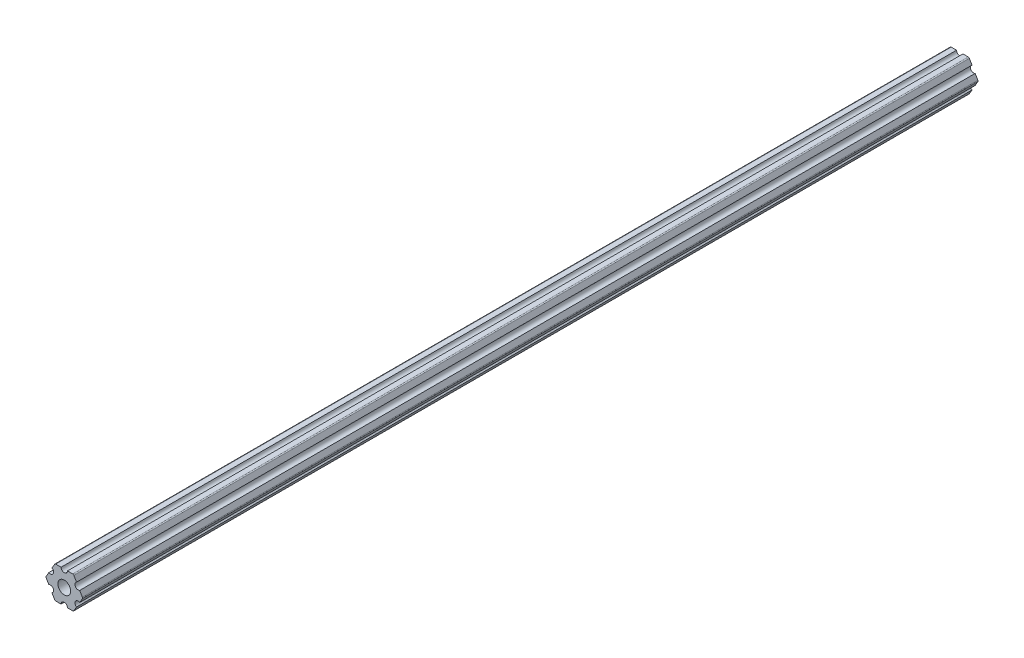
ISO-10303-21;
HEADER;
FILE_DESCRIPTION(('STEP AP214'),'2;1');
FILE_NAME('part.step','',(''),(''),'','','');
FILE_SCHEMA(('AUTOMOTIVE_DESIGN { 1 0 10303 214 1 1 1 1 }'));
ENDSEC;
DATA;
#1=APPLICATION_CONTEXT('core data for automotive mechanical design processes');
#2=APPLICATION_PROTOCOL_DEFINITION('international standard','automotive_design',2000,#1);
#3=PRODUCT_CONTEXT('',#1,'mechanical');
#4=PRODUCT('Part','Part','',(#3));
#5=PRODUCT_RELATED_PRODUCT_CATEGORY('part','',(#4));
#6=PRODUCT_DEFINITION_FORMATION('','',#4);
#7=PRODUCT_DEFINITION_CONTEXT('part definition',#1,'design');
#8=PRODUCT_DEFINITION('design','',#6,#7);
#9=PRODUCT_DEFINITION_SHAPE('','',#8);
#10=(LENGTH_UNIT() NAMED_UNIT(*) SI_UNIT(.MILLI.,.METRE.));
#11=(NAMED_UNIT(*) PLANE_ANGLE_UNIT() SI_UNIT($,.RADIAN.));
#12=(NAMED_UNIT(*) SI_UNIT($,.STERADIAN.) SOLID_ANGLE_UNIT());
#13=UNCERTAINTY_MEASURE_WITH_UNIT(LENGTH_MEASURE(1.E-05),#10,'distance_accuracy_value','');
#14=(GEOMETRIC_REPRESENTATION_CONTEXT(3) GLOBAL_UNCERTAINTY_ASSIGNED_CONTEXT((#13)) GLOBAL_UNIT_ASSIGNED_CONTEXT((#10,
#11,#12)) REPRESENTATION_CONTEXT('',''));
#15=CARTESIAN_POINT('',(0.,0.,0.));
#16=DIRECTION('',(0.,0.,1.));
#17=DIRECTION('',(1.,0.,0.));
#18=AXIS2_PLACEMENT_3D('',#15,#16,#17);
#19=CARTESIAN_POINT('',(3.66617420935418,-6.34999999999993,355.6));
#20=DIRECTION('',(-0.866025403784441,0.499999999999995,0.));
#21=DIRECTION('',(-0.499999999999995,-0.866025403784442,0.));
#22=AXIS2_PLACEMENT_3D('',#19,#20,#21);
#23=PLANE('',#22);
#24=DIRECTION('',(0.499999999999995,0.866025403784442,0.));
#25=VECTOR('',#24,1.);
#26=CARTESIAN_POINT('',(3.66617420935418,-6.34999999999993,355.6));
#27=LINE('',#26,#25);
#28=CARTESIAN_POINT('',(3.81282117772834,-6.09599999999993,355.6));
#29=VERTEX_POINT('',#28);
#30=CARTESIAN_POINT('',(4.86426131403121,-4.27485226280621,355.6));
#31=VERTEX_POINT('',#30);
#32=EDGE_CURVE('E326',#29,#31,#27,.T.);
#33=ORIENTED_EDGE('',*,*,#32,.F.);
#34=DIRECTION('',(0.,0.,-1.));
#35=VECTOR('',#34,1.);
#36=CARTESIAN_POINT('',(3.81282117772834,-6.09599999999993,355.6));
#37=LINE('',#36,#35);
#38=CARTESIAN_POINT('',(3.81282117772834,-6.09599999999993,0.));
#39=VERTEX_POINT('',#38);
#40=EDGE_CURVE('E286',#29,#39,#37,.T.);
#41=ORIENTED_EDGE('',*,*,#40,.T.);
#42=DIRECTION('',(0.499999999999995,0.866025403784442,0.));
#43=VECTOR('',#42,1.);
#44=CARTESIAN_POINT('',(3.66617420935418,-6.34999999999993,0.));
#45=LINE('',#44,#43);
#46=CARTESIAN_POINT('',(4.86426131403121,-4.27485226280621,0.));
#47=VERTEX_POINT('',#46);
#48=EDGE_CURVE('E220',#39,#47,#45,.T.);
#49=ORIENTED_EDGE('',*,*,#48,.T.);
#50=DIRECTION('',(0.,0.,1.));
#51=VECTOR('',#50,1.);
#52=CARTESIAN_POINT('',(4.86426131403121,-4.27485226280621,0.));
#53=LINE('',#52,#51);
#54=EDGE_CURVE('E381',#47,#31,#53,.T.);
#55=ORIENTED_EDGE('',*,*,#54,.T.);
#56=EDGE_LOOP('',(#33,#41,#49,#55));
#57=FACE_BOUND('',#56,.T.);
#58=ADVANCED_FACE('F36',(#57),#23,.F.);
#59=CARTESIAN_POINT('',(7.33234841870822,0.,355.6));
#60=DIRECTION('',(-0.866025403784438,-0.500000000000001,0.));
#61=DIRECTION('',(0.500000000000001,-0.866025403784438,0.));
#62=AXIS2_PLACEMENT_3D('',#59,#60,#61);
#63=PLANE('',#62);
#64=DIRECTION('',(-0.500000000000001,0.866025403784438,0.));
#65=VECTOR('',#64,1.);
#66=CARTESIAN_POINT('',(7.33234841870822,0.,355.6));
#67=LINE('',#66,#65);
#68=CARTESIAN_POINT('',(7.18570145033405,0.253999999999999,355.6));
#69=VERTEX_POINT('',#68);
#70=CARTESIAN_POINT('',(6.13426131403116,2.07514773719376,355.6));
#71=VERTEX_POINT('',#70);
#72=EDGE_CURVE('E328',#69,#71,#67,.T.);
#73=ORIENTED_EDGE('',*,*,#72,.F.);
#74=DIRECTION('',(0.,0.,-1.));
#75=VECTOR('',#74,1.);
#76=CARTESIAN_POINT('',(7.18570145033405,0.253999999999999,355.6));
#77=LINE('',#76,#75);
#78=CARTESIAN_POINT('',(7.18570145033405,0.253999999999999,0.));
#79=VERTEX_POINT('',#78);
#80=EDGE_CURVE('E291',#69,#79,#77,.T.);
#81=ORIENTED_EDGE('',*,*,#80,.T.);
#82=DIRECTION('',(-0.500000000000001,0.866025403784438,0.));
#83=VECTOR('',#82,1.);
#84=CARTESIAN_POINT('',(7.33234841870822,0.,0.));
#85=LINE('',#84,#83);
#86=CARTESIAN_POINT('',(6.13426131403116,2.07514773719376,0.));
#87=VERTEX_POINT('',#86);
#88=EDGE_CURVE('E219',#79,#87,#85,.T.);
#89=ORIENTED_EDGE('',*,*,#88,.T.);
#90=DIRECTION('',(0.,0.,1.));
#91=VECTOR('',#90,1.);
#92=CARTESIAN_POINT('',(6.13426131403116,2.07514773719376,0.));
#93=LINE('',#92,#91);
#94=EDGE_CURVE('E204',#87,#71,#93,.T.);
#95=ORIENTED_EDGE('',*,*,#94,.T.);
#96=EDGE_LOOP('',(#73,#81,#89,#95));
#97=FACE_BOUND('',#96,.T.);
#98=ADVANCED_FACE('F447',(#97),#63,.F.);
#99=CARTESIAN_POINT('',(3.66617420935409,6.34999999999998,355.6));
#100=DIRECTION('',(0.,-1.,0.));
#101=DIRECTION('',(1.,0.,0.));
#102=AXIS2_PLACEMENT_3D('',#99,#100,#101);
#103=PLANE('',#102);
#104=DIRECTION('',(-1.,0.,0.));
#105=VECTOR('',#104,1.);
#106=CARTESIAN_POINT('',(3.66617420935409,6.34999999999998,355.6));
#107=LINE('',#106,#105);
#108=CARTESIAN_POINT('',(3.37288027260576,6.34999999999998,355.6));
#109=VERTEX_POINT('',#108);
#110=CARTESIAN_POINT('',(1.26999999999998,6.34999999999997,355.6));
#111=VERTEX_POINT('',#110);
#112=EDGE_CURVE('E301',#109,#111,#107,.T.);
#113=ORIENTED_EDGE('',*,*,#112,.F.);
#114=DIRECTION('',(0.,0.,-1.));
#115=VECTOR('',#114,1.);
#116=CARTESIAN_POINT('',(3.37288027260576,6.34999999999998,355.6));
#117=LINE('',#116,#115);
#118=CARTESIAN_POINT('',(3.37288027260576,6.34999999999998,0.));
#119=VERTEX_POINT('',#118);
#120=EDGE_CURVE('E44',#109,#119,#117,.T.);
#121=ORIENTED_EDGE('',*,*,#120,.T.);
#122=DIRECTION('',(-1.,0.,0.));
#123=VECTOR('',#122,1.);
#124=CARTESIAN_POINT('',(3.66617420935409,6.34999999999998,0.));
#125=LINE('',#124,#123);
#126=CARTESIAN_POINT('',(1.26999999999998,6.34999999999997,0.));
#127=VERTEX_POINT('',#126);
#128=EDGE_CURVE('E227',#119,#127,#125,.T.);
#129=ORIENTED_EDGE('',*,*,#128,.T.);
#130=DIRECTION('',(0.,0.,1.));
#131=VECTOR('',#130,1.);
#132=CARTESIAN_POINT('',(1.26999999999998,6.34999999999997,0.));
#133=LINE('',#132,#131);
#134=EDGE_CURVE('E311',#127,#111,#133,.T.);
#135=ORIENTED_EDGE('',*,*,#134,.T.);
#136=EDGE_LOOP('',(#113,#121,#129,#135));
#137=FACE_BOUND('',#136,.T.);
#138=ADVANCED_FACE('F298',(#137),#103,.F.);
#139=CARTESIAN_POINT('',(-3.66617420935414,6.34999999999996,355.6));
#140=DIRECTION('',(0.866025403784442,-0.499999999999995,0.));
#141=DIRECTION('',(0.499999999999995,0.866025403784442,0.));
#142=AXIS2_PLACEMENT_3D('',#139,#140,#141);
#143=PLANE('',#142);
#144=DIRECTION('',(-0.499999999999995,-0.866025403784441,0.));
#145=VECTOR('',#144,1.);
#146=CARTESIAN_POINT('',(-3.66617420935414,6.34999999999996,355.6));
#147=LINE('',#146,#145);
#148=CARTESIAN_POINT('',(-3.8128211777283,6.09599999999995,355.6));
#149=VERTEX_POINT('',#148);
#150=CARTESIAN_POINT('',(-4.86426131403118,4.27485226280619,355.6));
#151=VERTEX_POINT('',#150);
#152=EDGE_CURVE('E332',#149,#151,#147,.T.);
#153=ORIENTED_EDGE('',*,*,#152,.F.);
#154=DIRECTION('',(0.,0.,-1.));
#155=VECTOR('',#154,1.);
#156=CARTESIAN_POINT('',(-3.8128211777283,6.09599999999995,355.6));
#157=LINE('',#156,#155);
#158=CARTESIAN_POINT('',(-3.8128211777283,6.09599999999995,0.));
#159=VERTEX_POINT('',#158);
#160=EDGE_CURVE('E249',#149,#159,#157,.T.);
#161=ORIENTED_EDGE('',*,*,#160,.T.);
#162=DIRECTION('',(-0.499999999999995,-0.866025403784441,0.));
#163=VECTOR('',#162,1.);
#164=CARTESIAN_POINT('',(-3.66617420935414,6.34999999999996,0.));
#165=LINE('',#164,#163);
#166=CARTESIAN_POINT('',(-4.86426131403118,4.27485226280619,0.));
#167=VERTEX_POINT('',#166);
#168=EDGE_CURVE('E230',#159,#167,#165,.T.);
#169=ORIENTED_EDGE('',*,*,#168,.T.);
#170=DIRECTION('',(0.,0.,1.));
#171=VECTOR('',#170,1.);
#172=CARTESIAN_POINT('',(-4.86426131403118,4.27485226280619,0.));
#173=LINE('',#172,#171);
#174=EDGE_CURVE('E318',#167,#151,#173,.T.);
#175=ORIENTED_EDGE('',*,*,#174,.T.);
#176=EDGE_LOOP('',(#153,#161,#169,#175));
#177=FACE_BOUND('',#176,.T.);
#178=ADVANCED_FACE('F502',(#177),#143,.F.);
#179=CARTESIAN_POINT('',(-7.33234841870822,0.,355.6));
#180=DIRECTION('',(0.866025403784434,0.500000000000007,0.));
#181=DIRECTION('',(-0.500000000000007,0.866025403784435,0.));
#182=AXIS2_PLACEMENT_3D('',#179,#180,#181);
#183=PLANE('',#182);
#184=DIRECTION('',(0.500000000000007,-0.866025403784435,0.));
#185=VECTOR('',#184,1.);
#186=CARTESIAN_POINT('',(-7.33234841870822,0.,355.6));
#187=LINE('',#186,#185);
#188=CARTESIAN_POINT('',(-7.18570145033405,-0.254000000000051,355.6));
#189=VERTEX_POINT('',#188);
#190=CARTESIAN_POINT('',(-6.13426131403114,-2.0751477371938,355.6));
#191=VERTEX_POINT('',#190);
#192=EDGE_CURVE('E335',#189,#191,#187,.T.);
#193=ORIENTED_EDGE('',*,*,#192,.F.);
#194=DIRECTION('',(0.,0.,-1.));
#195=VECTOR('',#194,1.);
#196=CARTESIAN_POINT('',(-7.18570145033405,-0.254000000000051,355.6));
#197=LINE('',#196,#195);
#198=CARTESIAN_POINT('',(-7.18570145033405,-0.254000000000051,0.));
#199=VERTEX_POINT('',#198);
#200=EDGE_CURVE('E276',#189,#199,#197,.T.);
#201=ORIENTED_EDGE('',*,*,#200,.T.);
#202=DIRECTION('',(0.500000000000007,-0.866025403784435,0.));
#203=VECTOR('',#202,1.);
#204=CARTESIAN_POINT('',(-7.33234841870822,0.,0.));
#205=LINE('',#204,#203);
#206=CARTESIAN_POINT('',(-6.13426131403114,-2.0751477371938,0.));
#207=VERTEX_POINT('',#206);
#208=EDGE_CURVE('E233',#199,#207,#205,.T.);
#209=ORIENTED_EDGE('',*,*,#208,.T.);
#210=DIRECTION('',(0.,0.,1.));
#211=VECTOR('',#210,1.);
#212=CARTESIAN_POINT('',(-6.13426131403114,-2.0751477371938,0.));
#213=LINE('',#212,#211);
#214=EDGE_CURVE('E391',#207,#191,#213,.T.);
#215=ORIENTED_EDGE('',*,*,#214,.T.);
#216=EDGE_LOOP('',(#193,#201,#209,#215));
#217=FACE_BOUND('',#216,.T.);
#218=ADVANCED_FACE('F411',(#217),#183,.F.);
#219=CARTESIAN_POINT('',(-3.66617420935405,-6.35000000000001,355.6));
#220=DIRECTION('',(0.,1.,0.));
#221=DIRECTION('',(-1.,0.,0.));
#222=AXIS2_PLACEMENT_3D('',#219,#220,#221);
#223=PLANE('',#222);
#224=DIRECTION('',(1.,0.,0.));
#225=VECTOR('',#224,1.);
#226=CARTESIAN_POINT('',(-3.66617420935405,-6.35000000000001,355.6));
#227=LINE('',#226,#225);
#228=CARTESIAN_POINT('',(-3.37288027260572,-6.35,355.6));
#229=VERTEX_POINT('',#228);
#230=CARTESIAN_POINT('',(-1.26999999999993,-6.34999999999998,355.6));
#231=VERTEX_POINT('',#230);
#232=EDGE_CURVE('E243',#229,#231,#227,.T.);
#233=ORIENTED_EDGE('',*,*,#232,.F.);
#234=DIRECTION('',(0.,0.,-1.));
#235=VECTOR('',#234,1.);
#236=CARTESIAN_POINT('',(-3.37288027260572,-6.35,355.6));
#237=LINE('',#236,#235);
#238=CARTESIAN_POINT('',(-3.37288027260572,-6.35,0.));
#239=VERTEX_POINT('',#238);
#240=EDGE_CURVE('E281',#229,#239,#237,.T.);
#241=ORIENTED_EDGE('',*,*,#240,.T.);
#242=DIRECTION('',(1.,0.,0.));
#243=VECTOR('',#242,1.);
#244=CARTESIAN_POINT('',(-3.66617420935405,-6.35000000000001,0.));
#245=LINE('',#244,#243);
#246=CARTESIAN_POINT('',(-1.26999999999993,-6.34999999999998,0.));
#247=VERTEX_POINT('',#246);
#248=EDGE_CURVE('E236',#239,#247,#245,.T.);
#249=ORIENTED_EDGE('',*,*,#248,.T.);
#250=DIRECTION('',(0.,0.,1.));
#251=VECTOR('',#250,1.);
#252=CARTESIAN_POINT('',(-1.26999999999993,-6.34999999999998,0.));
#253=LINE('',#252,#251);
#254=EDGE_CURVE('E385',#247,#231,#253,.T.);
#255=ORIENTED_EDGE('',*,*,#254,.T.);
#256=EDGE_LOOP('',(#233,#241,#249,#255));
#257=FACE_BOUND('',#256,.T.);
#258=ADVANCED_FACE('F429',(#257),#223,.F.);
#259=CARTESIAN_POINT('',(6.13426131403119,-2.07514773719372,0.));
#260=VERTEX_POINT('',#259);
#261=CARTESIAN_POINT('',(7.18570145033406,-0.253999999999997,0.));
#262=VERTEX_POINT('',#261);
#263=EDGE_CURVE('E223',#260,#262,#45,.T.);
#264=ORIENTED_EDGE('',*,*,#263,.T.);
#265=DIRECTION('',(0.,0.,-1.));
#266=VECTOR('',#265,1.);
#267=CARTESIAN_POINT('',(7.18570145033405,-0.253999999999999,355.6));
#268=LINE('',#267,#266);
#269=CARTESIAN_POINT('',(7.18570145033406,-0.253999999999997,355.6));
#270=VERTEX_POINT('',#269);
#271=EDGE_CURVE('E294',#262,#270,#268,.F.);
#272=ORIENTED_EDGE('',*,*,#271,.T.);
#273=CARTESIAN_POINT('',(6.13426131403119,-2.07514773719372,355.6));
#274=VERTEX_POINT('',#273);
#275=EDGE_CURVE('E238',#274,#270,#27,.T.);
#276=ORIENTED_EDGE('',*,*,#275,.F.);
#277=DIRECTION('',(0.,0.,1.));
#278=VECTOR('',#277,1.);
#279=CARTESIAN_POINT('',(6.13426131403119,-2.07514773719372,0.));
#280=LINE('',#279,#278);
#281=EDGE_CURVE('E379',#274,#260,#280,.F.);
#282=ORIENTED_EDGE('',*,*,#281,.T.);
#283=EDGE_LOOP('',(#264,#272,#276,#282));
#284=FACE_BOUND('',#283,.T.);
#285=ADVANCED_FACE('F445',(#284),#23,.F.);
#286=CARTESIAN_POINT('',(4.86426131403115,4.27485226280623,0.));
#287=VERTEX_POINT('',#286);
#288=CARTESIAN_POINT('',(3.81282117772826,6.09599999999998,0.));
#289=VERTEX_POINT('',#288);
#290=EDGE_CURVE('E212',#287,#289,#85,.T.);
#291=ORIENTED_EDGE('',*,*,#290,.T.);
#292=DIRECTION('',(0.,0.,-1.));
#293=VECTOR('',#292,1.);
#294=CARTESIAN_POINT('',(3.81282117772826,6.09599999999998,355.6));
#295=LINE('',#294,#293);
#296=CARTESIAN_POINT('',(3.81282117772826,6.09599999999998,355.6));
#297=VERTEX_POINT('',#296);
#298=EDGE_CURVE('E11',#289,#297,#295,.F.);
#299=ORIENTED_EDGE('',*,*,#298,.T.);
#300=CARTESIAN_POINT('',(4.86426131403115,4.27485226280623,355.6));
#301=VERTEX_POINT('',#300);
#302=EDGE_CURVE('E213',#301,#297,#67,.T.);
#303=ORIENTED_EDGE('',*,*,#302,.F.);
#304=DIRECTION('',(0.,0.,1.));
#305=VECTOR('',#304,1.);
#306=CARTESIAN_POINT('',(4.86426131403115,4.27485226280623,0.));
#307=LINE('',#306,#305);
#308=EDGE_CURVE('E201',#301,#287,#307,.F.);
#309=ORIENTED_EDGE('',*,*,#308,.T.);
#310=EDGE_LOOP('',(#291,#299,#303,#309));
#311=FACE_BOUND('',#310,.T.);
#312=ADVANCED_FACE('F211',(#311),#63,.F.);
#313=CARTESIAN_POINT('',(-1.27000000000002,6.34999999999996,0.));
#314=VERTEX_POINT('',#313);
#315=CARTESIAN_POINT('',(-3.37288027260581,6.34999999999996,0.));
#316=VERTEX_POINT('',#315);
#317=EDGE_CURVE('E222',#314,#316,#125,.T.);
#318=ORIENTED_EDGE('',*,*,#317,.T.);
#319=DIRECTION('',(0.,0.,-1.));
#320=VECTOR('',#319,1.);
#321=CARTESIAN_POINT('',(-3.37288027260581,6.34999999999996,355.6));
#322=LINE('',#321,#320);
#323=CARTESIAN_POINT('',(-3.37288027260581,6.34999999999996,355.6));
#324=VERTEX_POINT('',#323);
#325=EDGE_CURVE('E263',#316,#324,#322,.F.);
#326=ORIENTED_EDGE('',*,*,#325,.T.);
#327=CARTESIAN_POINT('',(-1.27000000000002,6.34999999999996,355.6));
#328=VERTEX_POINT('',#327);
#329=EDGE_CURVE('E317',#328,#324,#107,.T.);
#330=ORIENTED_EDGE('',*,*,#329,.F.);
#331=DIRECTION('',(0.,0.,1.));
#332=VECTOR('',#331,1.);
#333=CARTESIAN_POINT('',(-1.27000000000002,6.34999999999996,0.));
#334=LINE('',#333,#332);
#335=EDGE_CURVE('E309',#328,#314,#334,.F.);
#336=ORIENTED_EDGE('',*,*,#335,.T.);
#337=EDGE_LOOP('',(#318,#326,#330,#336));
#338=FACE_BOUND('',#337,.T.);
#339=ADVANCED_FACE('F314',(#338),#103,.F.);
#340=CARTESIAN_POINT('',(-6.13426131403117,2.07514773719371,0.));
#341=VERTEX_POINT('',#340);
#342=CARTESIAN_POINT('',(-7.18570145033405,0.253999999999951,0.));
#343=VERTEX_POINT('',#342);
#344=EDGE_CURVE('E229',#341,#343,#165,.T.);
#345=ORIENTED_EDGE('',*,*,#344,.T.);
#346=DIRECTION('',(0.,0.,-1.));
#347=VECTOR('',#346,1.);
#348=CARTESIAN_POINT('',(-7.18570145033405,0.253999999999951,355.6));
#349=LINE('',#348,#347);
#350=CARTESIAN_POINT('',(-7.18570145033405,0.253999999999951,355.6));
#351=VERTEX_POINT('',#350);
#352=EDGE_CURVE('E279',#343,#351,#349,.F.);
#353=ORIENTED_EDGE('',*,*,#352,.T.);
#354=CARTESIAN_POINT('',(-6.13426131403117,2.07514773719371,355.6));
#355=VERTEX_POINT('',#354);
#356=EDGE_CURVE('E331',#355,#351,#147,.T.);
#357=ORIENTED_EDGE('',*,*,#356,.F.);
#358=DIRECTION('',(0.,0.,1.));
#359=VECTOR('',#358,1.);
#360=CARTESIAN_POINT('',(-6.13426131403117,2.07514773719371,0.));
#361=LINE('',#360,#359);
#362=EDGE_CURVE('E322',#355,#341,#361,.F.);
#363=ORIENTED_EDGE('',*,*,#362,.T.);
#364=EDGE_LOOP('',(#345,#353,#357,#363));
#365=FACE_BOUND('',#364,.T.);
#366=ADVANCED_FACE('F398',(#365),#143,.F.);
#367=CARTESIAN_POINT('',(-4.86426131403112,-4.27485226280626,0.));
#368=VERTEX_POINT('',#367);
#369=CARTESIAN_POINT('',(-3.81282117772822,-6.09600000000001,0.));
#370=VERTEX_POINT('',#369);
#371=EDGE_CURVE('E232',#368,#370,#205,.T.);
#372=ORIENTED_EDGE('',*,*,#371,.T.);
#373=DIRECTION('',(0.,0.,-1.));
#374=VECTOR('',#373,1.);
#375=CARTESIAN_POINT('',(-3.81282117772822,-6.09600000000001,355.6));
#376=LINE('',#375,#374);
#377=CARTESIAN_POINT('',(-3.81282117772822,-6.09600000000001,355.6));
#378=VERTEX_POINT('',#377);
#379=EDGE_CURVE('E284',#370,#378,#376,.F.);
#380=ORIENTED_EDGE('',*,*,#379,.T.);
#381=CARTESIAN_POINT('',(-4.86426131403112,-4.27485226280626,355.6));
#382=VERTEX_POINT('',#381);
#383=EDGE_CURVE('E334',#382,#378,#187,.T.);
#384=ORIENTED_EDGE('',*,*,#383,.F.);
#385=DIRECTION('',(0.,0.,1.));
#386=VECTOR('',#385,1.);
#387=CARTESIAN_POINT('',(-4.86426131403112,-4.27485226280626,0.));
#388=LINE('',#387,#386);
#389=EDGE_CURVE('E388',#382,#368,#388,.F.);
#390=ORIENTED_EDGE('',*,*,#389,.T.);
#391=EDGE_LOOP('',(#372,#380,#384,#390));
#392=FACE_BOUND('',#391,.T.);
#393=ADVANCED_FACE('F421',(#392),#183,.F.);
#394=CARTESIAN_POINT('',(1.27000000000007,-6.34999999999996,0.));
#395=VERTEX_POINT('',#394);
#396=CARTESIAN_POINT('',(3.37288027260585,-6.34999999999993,0.));
#397=VERTEX_POINT('',#396);
#398=EDGE_CURVE('E235',#395,#397,#245,.T.);
#399=ORIENTED_EDGE('',*,*,#398,.T.);
#400=DIRECTION('',(0.,0.,-1.));
#401=VECTOR('',#400,1.);
#402=CARTESIAN_POINT('',(3.37288027260585,-6.34999999999993,355.6));
#403=LINE('',#402,#401);
#404=CARTESIAN_POINT('',(3.37288027260585,-6.34999999999993,355.6));
#405=VERTEX_POINT('',#404);
#406=EDGE_CURVE('E289',#397,#405,#403,.F.);
#407=ORIENTED_EDGE('',*,*,#406,.T.);
#408=CARTESIAN_POINT('',(1.27000000000007,-6.34999999999996,355.6));
#409=VERTEX_POINT('',#408);
#410=EDGE_CURVE('E336',#409,#405,#227,.T.);
#411=ORIENTED_EDGE('',*,*,#410,.F.);
#412=DIRECTION('',(0.,0.,1.));
#413=VECTOR('',#412,1.);
#414=CARTESIAN_POINT('',(1.27000000000007,-6.34999999999996,0.));
#415=LINE('',#414,#413);
#416=EDGE_CURVE('E383',#409,#395,#415,.F.);
#417=ORIENTED_EDGE('',*,*,#416,.T.);
#418=EDGE_LOOP('',(#399,#407,#411,#417));
#419=FACE_BOUND('',#418,.T.);
#420=ADVANCED_FACE('F433',(#419),#223,.F.);
#421=CARTESIAN_POINT('',(0.,0.,355.6));
#422=DIRECTION('',(0.,0.,1.));
#423=DIRECTION('',(1.,0.,0.));
#424=AXIS2_PLACEMENT_3D('',#421,#422,#423);
#425=PLANE('',#424);
#426=CARTESIAN_POINT('',(0.,0.,355.6));
#427=DIRECTION('',(0.,0.,1.));
#428=DIRECTION('',(1.,0.,0.));
#429=AXIS2_PLACEMENT_3D('',#426,#427,#428);
#430=CIRCLE('',#429,2.55269999999999);
#431=CARTESIAN_POINT('',(2.55269999999999,0.,355.6));
#432=VERTEX_POINT('',#431);
#433=EDGE_CURVE('E490',#432,#432,#430,.T.);
#434=ORIENTED_EDGE('',*,*,#433,.F.);
#435=EDGE_LOOP('',(#434));
#436=FACE_BOUND('',#435,.T.);
#437=ORIENTED_EDGE('',*,*,#329,.T.);
#438=CARTESIAN_POINT('',(-3.3728802726058,5.84199999999996,355.6));
#439=DIRECTION('',(0.,0.,1.));
#440=DIRECTION('',(1.,0.,0.));
#441=AXIS2_PLACEMENT_3D('',#438,#439,#440);
#442=CIRCLE('',#441,0.508);
#443=EDGE_CURVE('E274',#324,#149,#442,.T.);
#444=ORIENTED_EDGE('',*,*,#443,.T.);
#445=ORIENTED_EDGE('',*,*,#152,.T.);
#446=CARTESIAN_POINT('',(-5.49926131403118,3.17499999999995,355.6));
#447=DIRECTION('',(0.,0.,1.));
#448=DIRECTION('',(1.,0.,0.));
#449=AXIS2_PLACEMENT_3D('',#446,#447,#448);
#450=CIRCLE('',#449,1.27);
#451=EDGE_CURVE('E376',#355,#151,#450,.T.);
#452=ORIENTED_EDGE('',*,*,#451,.F.);
#453=ORIENTED_EDGE('',*,*,#356,.T.);
#454=CARTESIAN_POINT('',(-6.74576054521156,0.,355.6));
#455=DIRECTION('',(0.,0.,1.));
#456=DIRECTION('',(1.,0.,0.));
#457=AXIS2_PLACEMENT_3D('',#454,#455,#456);
#458=CIRCLE('',#457,0.508);
#459=EDGE_CURVE('E272',#351,#189,#458,.T.);
#460=ORIENTED_EDGE('',*,*,#459,.T.);
#461=ORIENTED_EDGE('',*,*,#192,.T.);
#462=CARTESIAN_POINT('',(-5.49926131403113,-3.17500000000003,355.6));
#463=DIRECTION('',(0.,0.,1.));
#464=DIRECTION('',(1.,0.,0.));
#465=AXIS2_PLACEMENT_3D('',#462,#463,#464);
#466=CIRCLE('',#465,1.27);
#467=EDGE_CURVE('E374',#382,#191,#466,.T.);
#468=ORIENTED_EDGE('',*,*,#467,.F.);
#469=ORIENTED_EDGE('',*,*,#383,.T.);
#470=CARTESIAN_POINT('',(-3.37288027260572,-5.842,355.6));
#471=DIRECTION('',(0.,0.,1.));
#472=DIRECTION('',(1.,0.,0.));
#473=AXIS2_PLACEMENT_3D('',#470,#471,#472);
#474=CIRCLE('',#473,0.508);
#475=EDGE_CURVE('E270',#378,#229,#474,.T.);
#476=ORIENTED_EDGE('',*,*,#475,.T.);
#477=ORIENTED_EDGE('',*,*,#232,.T.);
#478=CARTESIAN_POINT('',(0.,-6.34999999999997,355.6));
#479=DIRECTION('',(0.,0.,1.));
#480=DIRECTION('',(1.,0.,0.));
#481=AXIS2_PLACEMENT_3D('',#478,#479,#480);
#482=CIRCLE('',#481,1.27);
#483=EDGE_CURVE('E345',#409,#231,#482,.T.);
#484=ORIENTED_EDGE('',*,*,#483,.F.);
#485=ORIENTED_EDGE('',*,*,#410,.T.);
#486=CARTESIAN_POINT('',(3.37288027260585,-5.84199999999993,355.6));
#487=DIRECTION('',(0.,0.,1.));
#488=DIRECTION('',(1.,0.,0.));
#489=AXIS2_PLACEMENT_3D('',#486,#487,#488);
#490=CIRCLE('',#489,0.508);
#491=EDGE_CURVE('E268',#405,#29,#490,.T.);
#492=ORIENTED_EDGE('',*,*,#491,.T.);
#493=ORIENTED_EDGE('',*,*,#32,.T.);
#494=CARTESIAN_POINT('',(5.4992613140312,-3.17499999999996,355.6));
#495=DIRECTION('',(0.,0.,1.));
#496=DIRECTION('',(1.,0.,0.));
#497=AXIS2_PLACEMENT_3D('',#494,#495,#496);
#498=CIRCLE('',#497,1.27);
#499=EDGE_CURVE('E364',#274,#31,#498,.T.);
#500=ORIENTED_EDGE('',*,*,#499,.F.);
#501=ORIENTED_EDGE('',*,*,#275,.T.);
#502=CARTESIAN_POINT('',(6.74576054521156,0.,355.6));
#503=DIRECTION('',(0.,0.,1.));
#504=DIRECTION('',(1.,0.,0.));
#505=AXIS2_PLACEMENT_3D('',#502,#503,#504);
#506=CIRCLE('',#505,0.508);
#507=EDGE_CURVE('E266',#270,#69,#506,.T.);
#508=ORIENTED_EDGE('',*,*,#507,.T.);
#509=ORIENTED_EDGE('',*,*,#72,.T.);
#510=CARTESIAN_POINT('',(5.49926131403115,3.17499999999999,355.6));
#511=DIRECTION('',(0.,0.,1.));
#512=DIRECTION('',(1.,0.,0.));
#513=AXIS2_PLACEMENT_3D('',#510,#511,#512);
#514=CIRCLE('',#513,1.27);
#515=EDGE_CURVE('E209',#301,#71,#514,.T.);
#516=ORIENTED_EDGE('',*,*,#515,.F.);
#517=ORIENTED_EDGE('',*,*,#302,.T.);
#518=CARTESIAN_POINT('',(3.37288027260576,5.84199999999998,355.6));
#519=DIRECTION('',(0.,0.,1.));
#520=DIRECTION('',(1.,0.,0.));
#521=AXIS2_PLACEMENT_3D('',#518,#519,#520);
#522=CIRCLE('',#521,0.508);
#523=EDGE_CURVE('E51',#297,#109,#522,.T.);
#524=ORIENTED_EDGE('',*,*,#523,.T.);
#525=ORIENTED_EDGE('',*,*,#112,.T.);
#526=CARTESIAN_POINT('',(0.,6.34999999999997,355.6));
#527=DIRECTION('',(0.,0.,1.));
#528=DIRECTION('',(1.,0.,0.));
#529=AXIS2_PLACEMENT_3D('',#526,#527,#528);
#530=CIRCLE('',#529,1.27);
#531=EDGE_CURVE('E208',#328,#111,#530,.T.);
#532=ORIENTED_EDGE('',*,*,#531,.F.);
#533=EDGE_LOOP('',(#437,#444,#445,#452,#453,#460,#461,#468,#469,#476,#477,#484,#485,#492,#493,
#500,#501,#508,#509,#516,#517,#524,#525,#532));
#534=FACE_BOUND('',#533,.T.);
#535=ADVANCED_FACE('F343',(#436,#534),#425,.T.);
#536=CARTESIAN_POINT('',(0.,0.,0.));
#537=DIRECTION('',(0.,0.,1.));
#538=DIRECTION('',(1.,0.,0.));
#539=AXIS2_PLACEMENT_3D('',#536,#537,#538);
#540=PLANE('',#539);
#541=CARTESIAN_POINT('',(0.,0.,0.));
#542=DIRECTION('',(0.,0.,1.));
#543=DIRECTION('',(1.,0.,0.));
#544=AXIS2_PLACEMENT_3D('',#541,#542,#543);
#545=CIRCLE('',#544,2.55269999999995);
#546=CARTESIAN_POINT('',(2.55269999999995,0.,0.));
#547=VERTEX_POINT('',#546);
#548=EDGE_CURVE('E488',#547,#547,#545,.T.);
#549=ORIENTED_EDGE('',*,*,#548,.T.);
#550=EDGE_LOOP('',(#549));
#551=FACE_BOUND('',#550,.T.);
#552=ORIENTED_EDGE('',*,*,#168,.F.);
#553=CARTESIAN_POINT('',(-3.3728802726058,5.84199999999996,0.));
#554=DIRECTION('',(0.,0.,1.));
#555=DIRECTION('',(1.,0.,0.));
#556=AXIS2_PLACEMENT_3D('',#553,#554,#555);
#557=CIRCLE('',#556,0.508);
#558=EDGE_CURVE('E261',#159,#316,#557,.F.);
#559=ORIENTED_EDGE('',*,*,#558,.T.);
#560=ORIENTED_EDGE('',*,*,#317,.F.);
#561=CARTESIAN_POINT('',(0.,6.34999999999997,0.));
#562=DIRECTION('',(0.,0.,1.));
#563=DIRECTION('',(1.,0.,0.));
#564=AXIS2_PLACEMENT_3D('',#561,#562,#563);
#565=CIRCLE('',#564,1.27);
#566=EDGE_CURVE('E246',#314,#127,#565,.T.);
#567=ORIENTED_EDGE('',*,*,#566,.T.);
#568=ORIENTED_EDGE('',*,*,#128,.F.);
#569=CARTESIAN_POINT('',(3.37288027260576,5.84199999999998,0.));
#570=DIRECTION('',(0.,0.,1.));
#571=DIRECTION('',(1.,0.,0.));
#572=AXIS2_PLACEMENT_3D('',#569,#570,#571);
#573=CIRCLE('',#572,0.508);
#574=EDGE_CURVE('E218',#119,#289,#573,.F.);
#575=ORIENTED_EDGE('',*,*,#574,.T.);
#576=ORIENTED_EDGE('',*,*,#290,.F.);
#577=CARTESIAN_POINT('',(5.49926131403115,3.17499999999999,0.));
#578=DIRECTION('',(0.,0.,1.));
#579=DIRECTION('',(1.,0.,0.));
#580=AXIS2_PLACEMENT_3D('',#577,#578,#579);
#581=CIRCLE('',#580,1.27);
#582=EDGE_CURVE('E197',#287,#87,#581,.T.);
#583=ORIENTED_EDGE('',*,*,#582,.T.);
#584=ORIENTED_EDGE('',*,*,#88,.F.);
#585=CARTESIAN_POINT('',(6.74576054521156,0.,0.));
#586=DIRECTION('',(0.,0.,1.));
#587=DIRECTION('',(1.,0.,0.));
#588=AXIS2_PLACEMENT_3D('',#585,#586,#587);
#589=CIRCLE('',#588,0.508);
#590=EDGE_CURVE('E253',#79,#262,#589,.F.);
#591=ORIENTED_EDGE('',*,*,#590,.T.);
#592=ORIENTED_EDGE('',*,*,#263,.F.);
#593=CARTESIAN_POINT('',(5.4992613140312,-3.17499999999996,0.));
#594=DIRECTION('',(0.,0.,1.));
#595=DIRECTION('',(1.,0.,0.));
#596=AXIS2_PLACEMENT_3D('',#593,#594,#595);
#597=CIRCLE('',#596,1.27);
#598=EDGE_CURVE('E360',#260,#47,#597,.T.);
#599=ORIENTED_EDGE('',*,*,#598,.T.);
#600=ORIENTED_EDGE('',*,*,#48,.F.);
#601=CARTESIAN_POINT('',(3.37288027260585,-5.84199999999993,0.));
#602=DIRECTION('',(0.,0.,1.));
#603=DIRECTION('',(1.,0.,0.));
#604=AXIS2_PLACEMENT_3D('',#601,#602,#603);
#605=CIRCLE('',#604,0.508);
#606=EDGE_CURVE('E255',#39,#397,#605,.F.);
#607=ORIENTED_EDGE('',*,*,#606,.T.);
#608=ORIENTED_EDGE('',*,*,#398,.F.);
#609=CARTESIAN_POINT('',(0.,-6.34999999999997,0.));
#610=DIRECTION('',(0.,0.,1.));
#611=DIRECTION('',(1.,0.,0.));
#612=AXIS2_PLACEMENT_3D('',#609,#610,#611);
#613=CIRCLE('',#612,1.27);
#614=EDGE_CURVE('E368',#395,#247,#613,.T.);
#615=ORIENTED_EDGE('',*,*,#614,.T.);
#616=ORIENTED_EDGE('',*,*,#248,.F.);
#617=CARTESIAN_POINT('',(-3.37288027260572,-5.842,0.));
#618=DIRECTION('',(0.,0.,1.));
#619=DIRECTION('',(1.,0.,0.));
#620=AXIS2_PLACEMENT_3D('',#617,#618,#619);
#621=CIRCLE('',#620,0.508);
#622=EDGE_CURVE('E257',#239,#370,#621,.F.);
#623=ORIENTED_EDGE('',*,*,#622,.T.);
#624=ORIENTED_EDGE('',*,*,#371,.F.);
#625=CARTESIAN_POINT('',(-5.49926131403113,-3.17500000000003,0.));
#626=DIRECTION('',(0.,0.,1.));
#627=DIRECTION('',(1.,0.,0.));
#628=AXIS2_PLACEMENT_3D('',#625,#626,#627);
#629=CIRCLE('',#628,1.27);
#630=EDGE_CURVE('E239',#368,#207,#629,.T.);
#631=ORIENTED_EDGE('',*,*,#630,.T.);
#632=ORIENTED_EDGE('',*,*,#208,.F.);
#633=CARTESIAN_POINT('',(-6.74576054521156,0.,0.));
#634=DIRECTION('',(0.,0.,1.));
#635=DIRECTION('',(1.,0.,0.));
#636=AXIS2_PLACEMENT_3D('',#633,#634,#635);
#637=CIRCLE('',#636,0.508);
#638=EDGE_CURVE('E259',#199,#343,#637,.F.);
#639=ORIENTED_EDGE('',*,*,#638,.T.);
#640=ORIENTED_EDGE('',*,*,#344,.F.);
#641=CARTESIAN_POINT('',(-5.49926131403118,3.17499999999995,0.));
#642=DIRECTION('',(0.,0.,1.));
#643=DIRECTION('',(1.,0.,0.));
#644=AXIS2_PLACEMENT_3D('',#641,#642,#643);
#645=CIRCLE('',#644,1.27);
#646=EDGE_CURVE('E242',#341,#167,#645,.T.);
#647=ORIENTED_EDGE('',*,*,#646,.T.);
#648=EDGE_LOOP('',(#552,#559,#560,#567,#568,#575,#576,#583,#584,#591,#592,#599,#600,#607,#608,
#615,#616,#623,#624,#631,#632,#639,#640,#647));
#649=FACE_BOUND('',#648,.T.);
#650=ADVANCED_FACE('F216',(#551,#649),#540,.F.);
#651=CARTESIAN_POINT('',(5.49926131403115,3.17499999999999,0.));
#652=DIRECTION('',(0.,0.,1.));
#653=DIRECTION('',(1.,0.,0.));
#654=AXIS2_PLACEMENT_3D('',#651,#652,#653);
#655=CYLINDRICAL_SURFACE('',#654,1.27);
#656=ORIENTED_EDGE('',*,*,#582,.F.);
#657=ORIENTED_EDGE('',*,*,#308,.F.);
#658=ORIENTED_EDGE('',*,*,#515,.T.);
#659=ORIENTED_EDGE('',*,*,#94,.F.);
#660=EDGE_LOOP('',(#656,#657,#658,#659));
#661=FACE_BOUND('',#660,.T.);
#662=ADVANCED_FACE('F199',(#661),#655,.F.);
#663=CARTESIAN_POINT('',(5.4992613140312,-3.17499999999996,0.));
#664=DIRECTION('',(0.,0.,1.));
#665=DIRECTION('',(1.,0.,0.));
#666=AXIS2_PLACEMENT_3D('',#663,#664,#665);
#667=CYLINDRICAL_SURFACE('',#666,1.27);
#668=ORIENTED_EDGE('',*,*,#598,.F.);
#669=ORIENTED_EDGE('',*,*,#281,.F.);
#670=ORIENTED_EDGE('',*,*,#499,.T.);
#671=ORIENTED_EDGE('',*,*,#54,.F.);
#672=EDGE_LOOP('',(#668,#669,#670,#671));
#673=FACE_BOUND('',#672,.T.);
#674=ADVANCED_FACE('F469',(#673),#667,.F.);
#675=CARTESIAN_POINT('',(0.,-6.34999999999997,0.));
#676=DIRECTION('',(0.,0.,1.));
#677=DIRECTION('',(1.,0.,0.));
#678=AXIS2_PLACEMENT_3D('',#675,#676,#677);
#679=CYLINDRICAL_SURFACE('',#678,1.27);
#680=ORIENTED_EDGE('',*,*,#614,.F.);
#681=ORIENTED_EDGE('',*,*,#416,.F.);
#682=ORIENTED_EDGE('',*,*,#483,.T.);
#683=ORIENTED_EDGE('',*,*,#254,.F.);
#684=EDGE_LOOP('',(#680,#681,#682,#683));
#685=FACE_BOUND('',#684,.T.);
#686=ADVANCED_FACE('F432',(#685),#679,.F.);
#687=CARTESIAN_POINT('',(-5.49926131403113,-3.17500000000003,0.));
#688=DIRECTION('',(0.,0.,1.));
#689=DIRECTION('',(1.,0.,0.));
#690=AXIS2_PLACEMENT_3D('',#687,#688,#689);
#691=CYLINDRICAL_SURFACE('',#690,1.27);
#692=ORIENTED_EDGE('',*,*,#630,.F.);
#693=ORIENTED_EDGE('',*,*,#389,.F.);
#694=ORIENTED_EDGE('',*,*,#467,.T.);
#695=ORIENTED_EDGE('',*,*,#214,.F.);
#696=EDGE_LOOP('',(#692,#693,#694,#695));
#697=FACE_BOUND('',#696,.T.);
#698=ADVANCED_FACE('F417',(#697),#691,.F.);
#699=CARTESIAN_POINT('',(-5.49926131403118,3.17499999999995,0.));
#700=DIRECTION('',(0.,0.,1.));
#701=DIRECTION('',(1.,0.,0.));
#702=AXIS2_PLACEMENT_3D('',#699,#700,#701);
#703=CYLINDRICAL_SURFACE('',#702,1.27);
#704=ORIENTED_EDGE('',*,*,#646,.F.);
#705=ORIENTED_EDGE('',*,*,#362,.F.);
#706=ORIENTED_EDGE('',*,*,#451,.T.);
#707=ORIENTED_EDGE('',*,*,#174,.F.);
#708=EDGE_LOOP('',(#704,#705,#706,#707));
#709=FACE_BOUND('',#708,.T.);
#710=ADVANCED_FACE('F481',(#709),#703,.F.);
#711=CARTESIAN_POINT('',(0.,6.34999999999997,0.));
#712=DIRECTION('',(0.,0.,1.));
#713=DIRECTION('',(1.,0.,0.));
#714=AXIS2_PLACEMENT_3D('',#711,#712,#713);
#715=CYLINDRICAL_SURFACE('',#714,1.27);
#716=ORIENTED_EDGE('',*,*,#566,.F.);
#717=ORIENTED_EDGE('',*,*,#335,.F.);
#718=ORIENTED_EDGE('',*,*,#531,.T.);
#719=ORIENTED_EDGE('',*,*,#134,.F.);
#720=EDGE_LOOP('',(#716,#717,#718,#719));
#721=FACE_BOUND('',#720,.T.);
#722=ADVANCED_FACE('F307',(#721),#715,.F.);
#723=CARTESIAN_POINT('',(-3.3728802726058,5.84199999999996,355.6));
#724=DIRECTION('',(0.,0.,-1.));
#725=DIRECTION('',(-1.,0.,0.));
#726=AXIS2_PLACEMENT_3D('',#723,#724,#725);
#727=CYLINDRICAL_SURFACE('',#726,0.508);
#728=ORIENTED_EDGE('',*,*,#443,.F.);
#729=ORIENTED_EDGE('',*,*,#325,.F.);
#730=ORIENTED_EDGE('',*,*,#558,.F.);
#731=ORIENTED_EDGE('',*,*,#160,.F.);
#732=EDGE_LOOP('',(#728,#729,#730,#731));
#733=FACE_BOUND('',#732,.T.);
#734=ADVANCED_FACE('F500',(#733),#727,.T.);
#735=CARTESIAN_POINT('',(-6.74576054521156,0.,355.6));
#736=DIRECTION('',(0.,0.,-1.));
#737=DIRECTION('',(-1.,0.,0.));
#738=AXIS2_PLACEMENT_3D('',#735,#736,#737);
#739=CYLINDRICAL_SURFACE('',#738,0.508);
#740=ORIENTED_EDGE('',*,*,#459,.F.);
#741=ORIENTED_EDGE('',*,*,#352,.F.);
#742=ORIENTED_EDGE('',*,*,#638,.F.);
#743=ORIENTED_EDGE('',*,*,#200,.F.);
#744=EDGE_LOOP('',(#740,#741,#742,#743));
#745=FACE_BOUND('',#744,.T.);
#746=ADVANCED_FACE('F408',(#745),#739,.T.);
#747=CARTESIAN_POINT('',(-3.37288027260572,-5.842,355.6));
#748=DIRECTION('',(0.,0.,-1.));
#749=DIRECTION('',(-1.,0.,0.));
#750=AXIS2_PLACEMENT_3D('',#747,#748,#749);
#751=CYLINDRICAL_SURFACE('',#750,0.508);
#752=ORIENTED_EDGE('',*,*,#475,.F.);
#753=ORIENTED_EDGE('',*,*,#379,.F.);
#754=ORIENTED_EDGE('',*,*,#622,.F.);
#755=ORIENTED_EDGE('',*,*,#240,.F.);
#756=EDGE_LOOP('',(#752,#753,#754,#755));
#757=FACE_BOUND('',#756,.T.);
#758=ADVANCED_FACE('F427',(#757),#751,.T.);
#759=CARTESIAN_POINT('',(3.37288027260585,-5.84199999999993,355.6));
#760=DIRECTION('',(0.,0.,-1.));
#761=DIRECTION('',(-1.,0.,0.));
#762=AXIS2_PLACEMENT_3D('',#759,#760,#761);
#763=CYLINDRICAL_SURFACE('',#762,0.508);
#764=ORIENTED_EDGE('',*,*,#491,.F.);
#765=ORIENTED_EDGE('',*,*,#406,.F.);
#766=ORIENTED_EDGE('',*,*,#606,.F.);
#767=ORIENTED_EDGE('',*,*,#40,.F.);
#768=EDGE_LOOP('',(#764,#765,#766,#767));
#769=FACE_BOUND('',#768,.T.);
#770=ADVANCED_FACE('F351',(#769),#763,.T.);
#771=CARTESIAN_POINT('',(6.74576054521156,0.,355.6));
#772=DIRECTION('',(0.,0.,-1.));
#773=DIRECTION('',(-1.,0.,0.));
#774=AXIS2_PLACEMENT_3D('',#771,#772,#773);
#775=CYLINDRICAL_SURFACE('',#774,0.508);
#776=ORIENTED_EDGE('',*,*,#507,.F.);
#777=ORIENTED_EDGE('',*,*,#271,.F.);
#778=ORIENTED_EDGE('',*,*,#590,.F.);
#779=ORIENTED_EDGE('',*,*,#80,.F.);
#780=EDGE_LOOP('',(#776,#777,#778,#779));
#781=FACE_BOUND('',#780,.T.);
#782=ADVANCED_FACE('F465',(#781),#775,.T.);
#783=CARTESIAN_POINT('',(3.37288027260576,5.84199999999998,355.6));
#784=DIRECTION('',(0.,0.,-1.));
#785=DIRECTION('',(-1.,0.,0.));
#786=AXIS2_PLACEMENT_3D('',#783,#784,#785);
#787=CYLINDRICAL_SURFACE('',#786,0.508);
#788=ORIENTED_EDGE('',*,*,#523,.F.);
#789=ORIENTED_EDGE('',*,*,#298,.F.);
#790=ORIENTED_EDGE('',*,*,#574,.F.);
#791=ORIENTED_EDGE('',*,*,#120,.F.);
#792=EDGE_LOOP('',(#788,#789,#790,#791));
#793=FACE_BOUND('',#792,.T.);
#794=ADVANCED_FACE('F38',(#793),#787,.T.);
#795=CARTESIAN_POINT('',(0.,0.,355.6));
#796=DIRECTION('',(0.,0.,1.));
#797=DIRECTION('',(1.,0.,0.));
#798=AXIS2_PLACEMENT_3D('',#795,#796,#797);
#799=CYLINDRICAL_SURFACE('',#798,2.55269999999997);
#800=ORIENTED_EDGE('',*,*,#548,.F.);
#801=EDGE_LOOP('',(#800));
#802=FACE_BOUND('',#801,.T.);
#803=ORIENTED_EDGE('',*,*,#433,.T.);
#804=EDGE_LOOP('',(#803));
#805=FACE_BOUND('',#804,.T.);
#806=ADVANCED_FACE('F510',(#802,#805),#799,.F.);
#807=CLOSED_SHELL('',(#58,#98,#138,#178,#218,#258,#285,#312,#339,#366,#393,#420,#535,#650,#662,
#674,#686,#698,#710,#722,#734,#746,#758,#770,#782,#794,#806));
#808=MANIFOLD_SOLID_BREP('B2',#807);
#809=ADVANCED_BREP_SHAPE_REPRESENTATION('',(#18,#808),#14);
#810=SHAPE_DEFINITION_REPRESENTATION(#9,#809);
ENDSEC;
END-ISO-10303-21;
